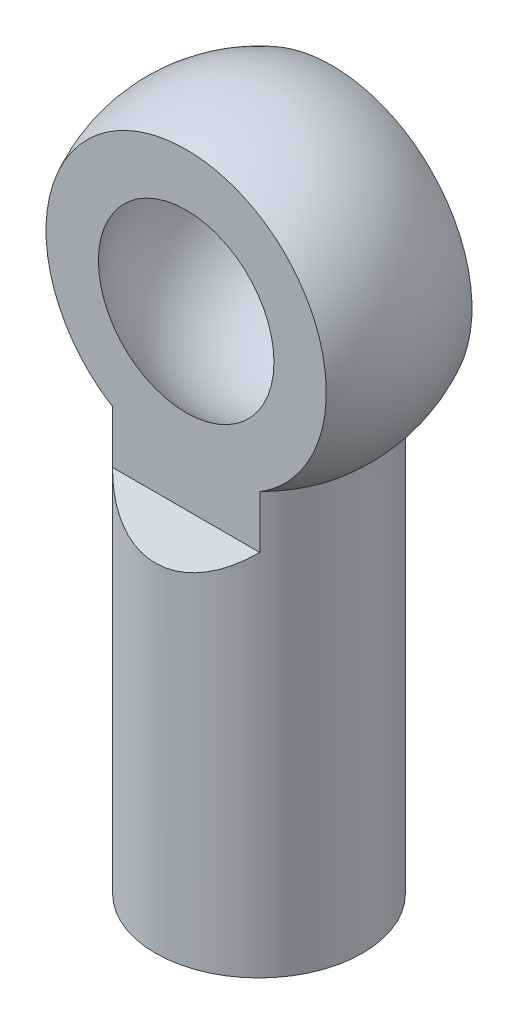
ISO-10303-21;
HEADER;
FILE_DESCRIPTION(('STEP AP214'),'2;1');
FILE_NAME('part.step','',(''),(''),'','','');
FILE_SCHEMA(('AUTOMOTIVE_DESIGN { 1 0 10303 214 1 1 1 1 }'));
ENDSEC;
DATA;
#1=APPLICATION_CONTEXT('core data for automotive mechanical design processes');
#2=APPLICATION_PROTOCOL_DEFINITION('international standard','automotive_design',2000,#1);
#3=PRODUCT_CONTEXT('',#1,'mechanical');
#4=PRODUCT('Part','Part','',(#3));
#5=PRODUCT_RELATED_PRODUCT_CATEGORY('part','',(#4));
#6=PRODUCT_DEFINITION_FORMATION('','',#4);
#7=PRODUCT_DEFINITION_CONTEXT('part definition',#1,'design');
#8=PRODUCT_DEFINITION('design','',#6,#7);
#9=PRODUCT_DEFINITION_SHAPE('','',#8);
#10=(LENGTH_UNIT() NAMED_UNIT(*) SI_UNIT(.MILLI.,.METRE.));
#11=(NAMED_UNIT(*) PLANE_ANGLE_UNIT() SI_UNIT($,.RADIAN.));
#12=(NAMED_UNIT(*) SI_UNIT($,.STERADIAN.) SOLID_ANGLE_UNIT());
#13=UNCERTAINTY_MEASURE_WITH_UNIT(LENGTH_MEASURE(1.E-05),#10,'distance_accuracy_value','');
#14=(GEOMETRIC_REPRESENTATION_CONTEXT(3) GLOBAL_UNCERTAINTY_ASSIGNED_CONTEXT((#13)) GLOBAL_UNIT_ASSIGNED_CONTEXT((#10,
#11,#12)) REPRESENTATION_CONTEXT('',''));
#15=CARTESIAN_POINT('',(0.,0.,0.));
#16=DIRECTION('',(0.,0.,1.));
#17=DIRECTION('',(1.,0.,0.));
#18=AXIS2_PLACEMENT_3D('',#15,#16,#17);
#19=CARTESIAN_POINT('',(-4.5,20.3907899194006,-2.075));
#20=DIRECTION('',(0.,0.,1.));
#21=DIRECTION('',(0.,-1.,0.));
#22=AXIS2_PLACEMENT_3D('',#19,#20,#21);
#23=PLANE('',#22);
#24=CARTESIAN_POINT('',(0.,15.3981612675092,-2.075));
#25=DIRECTION('',(0.,0.,1.));
#26=DIRECTION('',(0.,-1.,0.));
#27=AXIS2_PLACEMENT_3D('',#24,#25,#26);
#28=CIRCLE('',#27,3.99304082122885);
#29=CARTESIAN_POINT('',(2.0968726713847,12.,-2.075));
#30=VERTEX_POINT('',#29);
#31=CARTESIAN_POINT('',(-2.0968726713847,12.,-2.075));
#32=VERTEX_POINT('',#31);
#33=EDGE_CURVE('E112',#30,#32,#28,.T.);
#34=ORIENTED_EDGE('',*,*,#33,.F.);
#35=DIRECTION('',(0.,-1.,0.));
#36=VECTOR('',#35,1.);
#37=CARTESIAN_POINT('',(2.0968726713847,12.,-2.075));
#38=LINE('',#37,#36);
#39=CARTESIAN_POINT('',(2.0968726713847,10.5,-2.075));
#40=VERTEX_POINT('',#39);
#41=EDGE_CURVE('E85',#40,#30,#38,.F.);
#42=ORIENTED_EDGE('',*,*,#41,.F.);
#43=DIRECTION('',(1.,0.,0.));
#44=VECTOR('',#43,1.);
#45=CARTESIAN_POINT('',(-4.5,10.5,-2.075));
#46=LINE('',#45,#44);
#47=CARTESIAN_POINT('',(-2.0968726713847,10.5,-2.075));
#48=VERTEX_POINT('',#47);
#49=EDGE_CURVE('E79',#48,#40,#46,.T.);
#50=ORIENTED_EDGE('',*,*,#49,.F.);
#51=DIRECTION('',(0.,-1.,0.));
#52=VECTOR('',#51,1.);
#53=CARTESIAN_POINT('',(-2.0968726713847,12.,-2.075));
#54=LINE('',#53,#52);
#55=EDGE_CURVE('E49',#32,#48,#54,.T.);
#56=ORIENTED_EDGE('',*,*,#55,.F.);
#57=EDGE_LOOP('',(#34,#42,#50,#56));
#58=FACE_BOUND('',#57,.T.);
#59=CARTESIAN_POINT('',(0.,15.3981612675092,-2.075));
#60=DIRECTION('',(0.,0.,1.));
#61=DIRECTION('',(0.,-1.,0.));
#62=AXIS2_PLACEMENT_3D('',#59,#60,#61);
#63=CIRCLE('',#62,3.40000005799999);
#64=CARTESIAN_POINT('',(0.,11.9981612095092,-2.075));
#65=VERTEX_POINT('',#64);
#66=EDGE_CURVE('E11',#65,#65,#63,.F.);
#67=ORIENTED_EDGE('',*,*,#66,.F.);
#68=EDGE_LOOP('',(#67));
#69=FACE_BOUND('',#68,.T.);
#70=ADVANCED_FACE('F34',(#58,#69),#23,.F.);
#71=CARTESIAN_POINT('',(0.,12.,0.));
#72=DIRECTION('',(0.,-1.,0.));
#73=DIRECTION('',(0.,0.,-1.));
#74=AXIS2_PLACEMENT_3D('',#71,#72,#73);
#75=CYLINDRICAL_SURFACE('',#74,2.95);
#76=CARTESIAN_POINT('',(0.,12.,0.));
#77=DIRECTION('',(0.,1.,0.));
#78=DIRECTION('',(0.,0.,1.));
#79=AXIS2_PLACEMENT_3D('',#76,#77,#78);
#80=CIRCLE('',#79,2.95);
#81=CARTESIAN_POINT('',(2.0968726713847,12.,2.075));
#82=VERTEX_POINT('',#81);
#83=EDGE_CURVE('E109',#82,#30,#80,.T.);
#84=ORIENTED_EDGE('',*,*,#83,.F.);
#85=DIRECTION('',(0.,-1.,0.));
#86=VECTOR('',#85,1.);
#87=CARTESIAN_POINT('',(2.0968726713847,12.,2.075));
#88=LINE('',#87,#86);
#89=CARTESIAN_POINT('',(2.0968726713847,10.5,2.075));
#90=VERTEX_POINT('',#89);
#91=EDGE_CURVE('E57',#82,#90,#88,.T.);
#92=ORIENTED_EDGE('',*,*,#91,.T.);
#93=CARTESIAN_POINT('',(0.,12.575,0.));
#94=DIRECTION('',(0.,-0.707106781186544,-0.707106781186551));
#95=DIRECTION('',(0.,-0.707106781186551,0.707106781186544));
#96=AXIS2_PLACEMENT_3D('',#93,#94,#95);
#97=ELLIPSE('',#96,4.17193000900066,2.95);
#98=CARTESIAN_POINT('',(-2.0968726713847,10.5,2.075));
#99=VERTEX_POINT('',#98);
#100=EDGE_CURVE('E42',#90,#99,#97,.T.);
#101=ORIENTED_EDGE('',*,*,#100,.T.);
#102=DIRECTION('',(0.,-1.,0.));
#103=VECTOR('',#102,1.);
#104=CARTESIAN_POINT('',(-2.0968726713847,12.,2.075));
#105=LINE('',#104,#103);
#106=CARTESIAN_POINT('',(-2.0968726713847,12.,2.075));
#107=VERTEX_POINT('',#106);
#108=EDGE_CURVE('E95',#99,#107,#105,.F.);
#109=ORIENTED_EDGE('',*,*,#108,.T.);
#110=EDGE_CURVE('E94',#32,#107,#80,.T.);
#111=ORIENTED_EDGE('',*,*,#110,.F.);
#112=ORIENTED_EDGE('',*,*,#55,.T.);
#113=CARTESIAN_POINT('',(0.,12.575,0.));
#114=DIRECTION('',(0.,-0.707106781186544,0.707106781186551));
#115=DIRECTION('',(0.,-0.707106781186551,-0.707106781186544));
#116=AXIS2_PLACEMENT_3D('',#113,#114,#115);
#117=ELLIPSE('',#116,4.17193000900066,2.95);
#118=EDGE_CURVE('E77',#48,#40,#117,.T.);
#119=ORIENTED_EDGE('',*,*,#118,.T.);
#120=ORIENTED_EDGE('',*,*,#41,.T.);
#121=EDGE_LOOP('',(#84,#92,#101,#109,#111,#112,#119,#120));
#122=FACE_BOUND('',#121,.T.);
#123=CARTESIAN_POINT('',(0.,0.,0.));
#124=DIRECTION('',(0.,1.,0.));
#125=DIRECTION('',(0.,0.,1.));
#126=AXIS2_PLACEMENT_3D('',#123,#124,#125);
#127=CIRCLE('',#126,2.95);
#128=CARTESIAN_POINT('',(0.,0.,2.95));
#129=VERTEX_POINT('',#128);
#130=EDGE_CURVE('E105',#129,#129,#127,.T.);
#131=ORIENTED_EDGE('',*,*,#130,.T.);
#132=EDGE_LOOP('',(#131));
#133=FACE_BOUND('',#132,.T.);
#134=ADVANCED_FACE('F36',(#122,#133),#75,.T.);
#135=CARTESIAN_POINT('',(0.,0.,0.));
#136=DIRECTION('',(0.,1.,0.));
#137=DIRECTION('',(0.,0.,1.));
#138=AXIS2_PLACEMENT_3D('',#135,#136,#137);
#139=PLANE('',#138);
#140=CARTESIAN_POINT('',(0.,0.,0.));
#141=DIRECTION('',(0.,-1.,0.));
#142=DIRECTION('',(0.,0.,-1.));
#143=AXIS2_PLACEMENT_3D('',#140,#141,#142);
#144=CIRCLE('',#143,1.5);
#145=CARTESIAN_POINT('',(0.,0.,-1.5));
#146=VERTEX_POINT('',#145);
#147=EDGE_CURVE('E106',#146,#146,#144,.T.);
#148=ORIENTED_EDGE('',*,*,#147,.F.);
#149=EDGE_LOOP('',(#148));
#150=FACE_BOUND('',#149,.T.);
#151=ORIENTED_EDGE('',*,*,#130,.F.);
#152=EDGE_LOOP('',(#151));
#153=FACE_BOUND('',#152,.T.);
#154=ADVANCED_FACE('F156',(#150,#153),#139,.F.);
#155=CARTESIAN_POINT('',(0.,11.,0.));
#156=DIRECTION('',(0.,-1.,0.));
#157=DIRECTION('',(0.,0.,-1.));
#158=AXIS2_PLACEMENT_3D('',#155,#156,#157);
#159=CYLINDRICAL_SURFACE('',#158,1.5);
#160=CARTESIAN_POINT('',(0.,11.,0.));
#161=DIRECTION('',(0.,-1.,0.));
#162=DIRECTION('',(0.,0.,-1.));
#163=AXIS2_PLACEMENT_3D('',#160,#161,#162);
#164=CIRCLE('',#163,1.5);
#165=CARTESIAN_POINT('',(0.,11.,-1.5));
#166=VERTEX_POINT('',#165);
#167=EDGE_CURVE('E102',#166,#166,#164,.T.);
#168=ORIENTED_EDGE('',*,*,#167,.F.);
#169=EDGE_LOOP('',(#168));
#170=FACE_BOUND('',#169,.T.);
#171=ORIENTED_EDGE('',*,*,#147,.T.);
#172=EDGE_LOOP('',(#171));
#173=FACE_BOUND('',#172,.T.);
#174=ADVANCED_FACE('F235',(#170,#173),#159,.F.);
#175=CARTESIAN_POINT('',(0.,11.,0.));
#176=DIRECTION('',(0.,-1.,0.));
#177=DIRECTION('',(0.,0.,-1.));
#178=AXIS2_PLACEMENT_3D('',#175,#176,#177);
#179=PLANE('',#178);
#180=CARTESIAN_POINT('',(0.,11.,0.));
#181=DIRECTION('',(0.,-1.,0.));
#182=DIRECTION('',(0.,0.,-1.));
#183=AXIS2_PLACEMENT_3D('',#180,#181,#182);
#184=CIRCLE('',#183,0.951933540212518);
#185=CARTESIAN_POINT('',(0.,11.,-0.951933540212518));
#186=VERTEX_POINT('',#185);
#187=EDGE_CURVE('E101',#186,#186,#184,.F.);
#188=ORIENTED_EDGE('',*,*,#187,.T.);
#189=EDGE_LOOP('',(#188));
#190=FACE_BOUND('',#189,.T.);
#191=ORIENTED_EDGE('',*,*,#167,.T.);
#192=EDGE_LOOP('',(#191));
#193=FACE_BOUND('',#192,.T.);
#194=ADVANCED_FACE('F148',(#190,#193),#179,.T.);
#195=CARTESIAN_POINT('',(0.,15.3981612675092,0.));
#196=DIRECTION('',(0.,1.,0.));
#197=DIRECTION('',(0.,0.,-1.));
#198=AXIS2_PLACEMENT_3D('',#195,#196,#197);
#199=SPHERICAL_SURFACE('',#198,4.5);
#200=ORIENTED_EDGE('',*,*,#187,.F.);
#201=EDGE_LOOP('',(#200));
#202=FACE_BOUND('',#201,.T.);
#203=ADVANCED_FACE('F140',(#202),#199,.T.);
#204=ORIENTED_EDGE('',*,*,#110,.T.);
#205=CARTESIAN_POINT('',(0.,15.3981612675092,2.075));
#206=DIRECTION('',(0.,0.,-1.));
#207=DIRECTION('',(0.,1.,0.));
#208=AXIS2_PLACEMENT_3D('',#205,#206,#207);
#209=CIRCLE('',#208,3.99304082122885);
#210=EDGE_CURVE('E82',#107,#82,#209,.T.);
#211=ORIENTED_EDGE('',*,*,#210,.T.);
#212=ORIENTED_EDGE('',*,*,#83,.T.);
#213=ORIENTED_EDGE('',*,*,#33,.T.);
#214=EDGE_LOOP('',(#204,#211,#212,#213));
#215=FACE_BOUND('',#214,.T.);
#216=ADVANCED_FACE('F138',(#215),#199,.T.);
#217=CARTESIAN_POINT('',(-4.5,10.5,-2.075));
#218=DIRECTION('',(0.,-0.707106781186544,0.707106781186551));
#219=DIRECTION('',(0.,-0.707106781186551,-0.707106781186544));
#220=AXIS2_PLACEMENT_3D('',#217,#218,#219);
#221=PLANE('',#220);
#222=ORIENTED_EDGE('',*,*,#49,.T.);
#223=ORIENTED_EDGE('',*,*,#118,.F.);
#224=EDGE_LOOP('',(#222,#223));
#225=FACE_BOUND('',#224,.T.);
#226=ADVANCED_FACE('F78',(#225),#221,.F.);
#227=CARTESIAN_POINT('',(-4.5,10.5,2.075));
#228=DIRECTION('',(0.,-0.707106781186544,-0.707106781186551));
#229=DIRECTION('',(0.,0.707106781186551,-0.707106781186544));
#230=AXIS2_PLACEMENT_3D('',#227,#228,#229);
#231=PLANE('',#230);
#232=DIRECTION('',(1.,0.,0.));
#233=VECTOR('',#232,1.);
#234=CARTESIAN_POINT('',(-4.5,10.5,2.075));
#235=LINE('',#234,#233);
#236=EDGE_CURVE('E86',#99,#90,#235,.T.);
#237=ORIENTED_EDGE('',*,*,#236,.F.);
#238=ORIENTED_EDGE('',*,*,#100,.F.);
#239=EDGE_LOOP('',(#237,#238));
#240=FACE_BOUND('',#239,.T.);
#241=ADVANCED_FACE('F146',(#240),#231,.F.);
#242=CARTESIAN_POINT('',(-4.5,20.3907899194006,2.075));
#243=DIRECTION('',(0.,0.,-1.));
#244=DIRECTION('',(0.,1.,0.));
#245=AXIS2_PLACEMENT_3D('',#242,#243,#244);
#246=PLANE('',#245);
#247=CARTESIAN_POINT('',(0.,15.3981612675092,2.075));
#248=DIRECTION('',(0.,0.,-1.));
#249=DIRECTION('',(0.,1.,0.));
#250=AXIS2_PLACEMENT_3D('',#247,#248,#249);
#251=CIRCLE('',#250,2.50137462208283);
#252=CARTESIAN_POINT('',(0.,17.8995358895921,2.075));
#253=VERTEX_POINT('',#252);
#254=EDGE_CURVE('E87',#253,#253,#251,.F.);
#255=ORIENTED_EDGE('',*,*,#254,.F.);
#256=EDGE_LOOP('',(#255));
#257=FACE_BOUND('',#256,.T.);
#258=ORIENTED_EDGE('',*,*,#210,.F.);
#259=ORIENTED_EDGE('',*,*,#108,.F.);
#260=ORIENTED_EDGE('',*,*,#236,.T.);
#261=ORIENTED_EDGE('',*,*,#91,.F.);
#262=EDGE_LOOP('',(#258,#259,#260,#261));
#263=FACE_BOUND('',#262,.T.);
#264=ADVANCED_FACE('F135',(#257,#263),#246,.F.);
#265=CARTESIAN_POINT('',(0.,15.3981612675092,0.));
#266=DIRECTION('',(0.,0.,1.));
#267=DIRECTION('',(0.,1.,0.));
#268=AXIS2_PLACEMENT_3D('',#265,#266,#267);
#269=SPHERICAL_SURFACE('',#268,3.25);
#270=ORIENTED_EDGE('',*,*,#254,.T.);
#271=EDGE_LOOP('',(#270));
#272=FACE_BOUND('',#271,.T.);
#273=CARTESIAN_POINT('',(0.,15.3981612675092,-2.075));
#274=DIRECTION('',(0.,0.,-1.));
#275=DIRECTION('',(0.,1.,0.));
#276=AXIS2_PLACEMENT_3D('',#273,#274,#275);
#277=CIRCLE('',#276,2.50137462208283);
#278=CARTESIAN_POINT('',(0.,17.8995358895921,-2.075));
#279=VERTEX_POINT('',#278);
#280=EDGE_CURVE('E130',#279,#279,#277,.T.);
#281=ORIENTED_EDGE('',*,*,#280,.T.);
#282=EDGE_LOOP('',(#281));
#283=FACE_BOUND('',#282,.T.);
#284=ADVANCED_FACE('F162',(#272,#283),#269,.F.);
#285=CARTESIAN_POINT('',(0.,15.3981612675092,-2.095));
#286=DIRECTION('',(0.,0.,-1.));
#287=DIRECTION('',(0.,1.,0.));
#288=AXIS2_PLACEMENT_3D('',#285,#286,#287);
#289=PLANE('',#288);
#290=CARTESIAN_POINT('',(0.,15.3981612675092,-2.095));
#291=DIRECTION('',(0.,0.,-1.));
#292=DIRECTION('',(0.,1.,0.));
#293=AXIS2_PLACEMENT_3D('',#290,#291,#292);
#294=CIRCLE('',#293,3.40000005799999);
#295=CARTESIAN_POINT('',(0.,18.7981613255092,-2.095));
#296=VERTEX_POINT('',#295);
#297=EDGE_CURVE('E121',#296,#296,#294,.T.);
#298=ORIENTED_EDGE('',*,*,#297,.T.);
#299=EDGE_LOOP('',(#298));
#300=FACE_BOUND('',#299,.T.);
#301=CARTESIAN_POINT('',(0.,15.3981612675092,-2.095));
#302=DIRECTION('',(0.,0.,-1.));
#303=DIRECTION('',(0.,1.,0.));
#304=AXIS2_PLACEMENT_3D('',#301,#302,#303);
#305=CIRCLE('',#304,2.50137462208283);
#306=CARTESIAN_POINT('',(0.,17.8995358895921,-2.095));
#307=VERTEX_POINT('',#306);
#308=EDGE_CURVE('E125',#307,#307,#305,.T.);
#309=ORIENTED_EDGE('',*,*,#308,.F.);
#310=EDGE_LOOP('',(#309));
#311=FACE_BOUND('',#310,.T.);
#312=ADVANCED_FACE('F166',(#300,#311),#289,.T.);
#313=CARTESIAN_POINT('',(0.,15.3981612675092,-2.095));
#314=DIRECTION('',(0.,0.,1.));
#315=DIRECTION('',(0.,-1.,0.));
#316=AXIS2_PLACEMENT_3D('',#313,#314,#315);
#317=CYLINDRICAL_SURFACE('',#316,3.40000005799999);
#318=ORIENTED_EDGE('',*,*,#297,.F.);
#319=EDGE_LOOP('',(#318));
#320=FACE_BOUND('',#319,.T.);
#321=ORIENTED_EDGE('',*,*,#66,.T.);
#322=EDGE_LOOP('',(#321));
#323=FACE_BOUND('',#322,.T.);
#324=ADVANCED_FACE('F167',(#320,#323),#317,.T.);
#325=CARTESIAN_POINT('',(0.,15.3981612675092,-2.095));
#326=DIRECTION('',(0.,0.,1.));
#327=DIRECTION('',(0.,-1.,0.));
#328=AXIS2_PLACEMENT_3D('',#325,#326,#327);
#329=CYLINDRICAL_SURFACE('',#328,2.50137462208283);
#330=ORIENTED_EDGE('',*,*,#308,.T.);
#331=EDGE_LOOP('',(#330));
#332=FACE_BOUND('',#331,.T.);
#333=ORIENTED_EDGE('',*,*,#280,.F.);
#334=EDGE_LOOP('',(#333));
#335=FACE_BOUND('',#334,.T.);
#336=ADVANCED_FACE('F170',(#332,#335),#329,.F.);
#337=CLOSED_SHELL('',(#70,#134,#154,#174,#194,#203,#216,#226,#241,#264,#284,#312,#324,#336));
#338=MANIFOLD_SOLID_BREP('B2',#337);
#339=ADVANCED_BREP_SHAPE_REPRESENTATION('',(#18,#338),#14);
#340=SHAPE_DEFINITION_REPRESENTATION(#9,#339);
ENDSEC;
END-ISO-10303-21;
